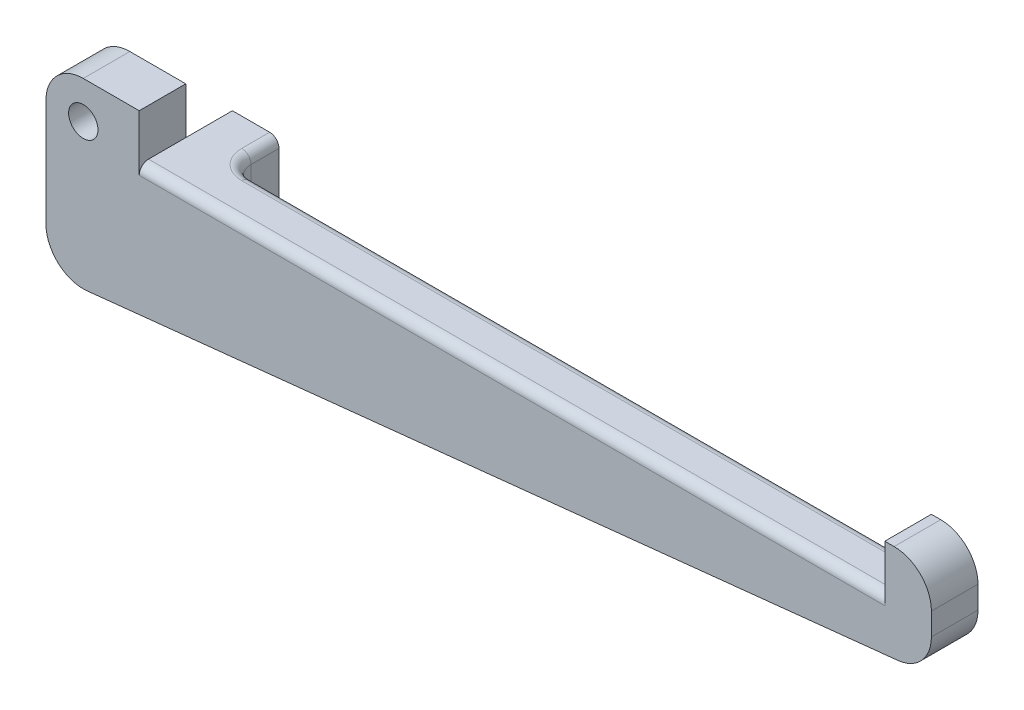
ISO-10303-21;
HEADER;
FILE_DESCRIPTION(('STEP AP214'),'2;1');
FILE_NAME('part.step','',(''),(''),'','','');
FILE_SCHEMA(('AUTOMOTIVE_DESIGN { 1 0 10303 214 1 1 1 1 }'));
ENDSEC;
DATA;
#1=APPLICATION_CONTEXT('core data for automotive mechanical design processes');
#2=APPLICATION_PROTOCOL_DEFINITION('international standard','automotive_design',2000,#1);
#3=PRODUCT_CONTEXT('',#1,'mechanical');
#4=PRODUCT('Part','Part','',(#3));
#5=PRODUCT_RELATED_PRODUCT_CATEGORY('part','',(#4));
#6=PRODUCT_DEFINITION_FORMATION('','',#4);
#7=PRODUCT_DEFINITION_CONTEXT('part definition',#1,'design');
#8=PRODUCT_DEFINITION('design','',#6,#7);
#9=PRODUCT_DEFINITION_SHAPE('','',#8);
#10=(LENGTH_UNIT() NAMED_UNIT(*) SI_UNIT(.MILLI.,.METRE.));
#11=(NAMED_UNIT(*) PLANE_ANGLE_UNIT() SI_UNIT($,.RADIAN.));
#12=(NAMED_UNIT(*) SI_UNIT($,.STERADIAN.) SOLID_ANGLE_UNIT());
#13=UNCERTAINTY_MEASURE_WITH_UNIT(LENGTH_MEASURE(1.E-05),#10,'distance_accuracy_value','');
#14=(GEOMETRIC_REPRESENTATION_CONTEXT(3) GLOBAL_UNCERTAINTY_ASSIGNED_CONTEXT((#13)) GLOBAL_UNIT_ASSIGNED_CONTEXT((#10,
#11,#12)) REPRESENTATION_CONTEXT('',''));
#15=CARTESIAN_POINT('',(0.,0.,0.));
#16=DIRECTION('',(0.,0.,1.));
#17=DIRECTION('',(1.,0.,0.));
#18=AXIS2_PLACEMENT_3D('',#15,#16,#17);
#19=CARTESIAN_POINT('',(5.08,-7.05719664596435,6.35));
#20=DIRECTION('',(0.,0.,-1.));
#21=DIRECTION('',(-1.,0.,0.));
#22=AXIS2_PLACEMENT_3D('',#19,#20,#21);
#23=CYLINDRICAL_SURFACE('',#22,5.08);
#24=CARTESIAN_POINT('',(5.08,-7.05719664596435,0.));
#25=DIRECTION('',(0.,0.,1.));
#26=DIRECTION('',(-1.,0.,0.));
#27=AXIS2_PLACEMENT_3D('',#24,#25,#26);
#28=CIRCLE('',#27,5.08);
#29=CARTESIAN_POINT('',(0.,-7.0571966459643,0.));
#30=VERTEX_POINT('',#29);
#31=CARTESIAN_POINT('',(5.6117987053517,-12.1092843468051,0.));
#32=VERTEX_POINT('',#31);
#33=EDGE_CURVE('E196',#30,#32,#28,.T.);
#34=ORIENTED_EDGE('',*,*,#33,.T.);
#35=DIRECTION('',(0.,0.,-1.));
#36=VECTOR('',#35,1.);
#37=CARTESIAN_POINT('',(5.6117987053517,-12.1092843468051,6.35));
#38=LINE('',#37,#36);
#39=CARTESIAN_POINT('',(5.6117987053517,-12.1092843468051,6.35));
#40=VERTEX_POINT('',#39);
#41=EDGE_CURVE('E326',#40,#32,#38,.T.);
#42=ORIENTED_EDGE('',*,*,#41,.F.);
#43=CARTESIAN_POINT('',(5.08,-7.05719664596435,6.35));
#44=DIRECTION('',(0.,0.,1.));
#45=DIRECTION('',(-1.,0.,0.));
#46=AXIS2_PLACEMENT_3D('',#43,#44,#45);
#47=CIRCLE('',#46,5.08);
#48=CARTESIAN_POINT('',(0.,-7.0571966459643,6.35));
#49=VERTEX_POINT('',#48);
#50=EDGE_CURVE('E228',#49,#40,#47,.T.);
#51=ORIENTED_EDGE('',*,*,#50,.F.);
#52=DIRECTION('',(0.,0.,-1.));
#53=VECTOR('',#52,1.);
#54=CARTESIAN_POINT('',(0.,-7.0571966459643,6.35));
#55=LINE('',#54,#53);
#56=EDGE_CURVE('E330',#49,#30,#55,.T.);
#57=ORIENTED_EDGE('',*,*,#56,.T.);
#58=EDGE_LOOP('',(#34,#42,#51,#57));
#59=FACE_BOUND('',#58,.T.);
#60=ADVANCED_FACE('F36',(#59),#23,.T.);
#61=CARTESIAN_POINT('',(116.101798705352,-0.478758031015618,6.35));
#62=DIRECTION('',(-0.104684784518043,0.994505452921406,0.));
#63=DIRECTION('',(-0.994505452921406,-0.104684784518043,0.));
#64=AXIS2_PLACEMENT_3D('',#61,#62,#63);
#65=PLANE('',#64);
#66=DIRECTION('',(0.994505452921406,0.104684784518043,0.));
#67=VECTOR('',#66,1.);
#68=CARTESIAN_POINT('',(116.101798705352,-0.478758031015618,0.));
#69=LINE('',#68,#67);
#70=CARTESIAN_POINT('',(116.101798705352,-0.478758031015619,0.));
#71=VERTEX_POINT('',#70);
#72=EDGE_CURVE('E261',#32,#71,#69,.T.);
#73=ORIENTED_EDGE('',*,*,#72,.T.);
#74=DIRECTION('',(0.,0.,-1.));
#75=VECTOR('',#74,1.);
#76=CARTESIAN_POINT('',(116.101798705352,-0.478758031015619,6.35));
#77=LINE('',#76,#75);
#78=CARTESIAN_POINT('',(116.101798705352,-0.478758031015619,6.35));
#79=VERTEX_POINT('',#78);
#80=EDGE_CURVE('E322',#79,#71,#77,.T.);
#81=ORIENTED_EDGE('',*,*,#80,.F.);
#82=DIRECTION('',(0.994505452921406,0.104684784518043,0.));
#83=VECTOR('',#82,1.);
#84=CARTESIAN_POINT('',(116.101798705352,-0.478758031015618,6.35));
#85=LINE('',#84,#83);
#86=EDGE_CURVE('E232',#40,#79,#85,.T.);
#87=ORIENTED_EDGE('',*,*,#86,.F.);
#88=ORIENTED_EDGE('',*,*,#41,.T.);
#89=EDGE_LOOP('',(#73,#81,#87,#88));
#90=FACE_BOUND('',#89,.T.);
#91=ADVANCED_FACE('F431',(#90),#65,.F.);
#92=CARTESIAN_POINT('',(115.57,4.57332966982513,6.35));
#93=DIRECTION('',(0.,0.,-1.));
#94=DIRECTION('',(-1.,0.,0.));
#95=AXIS2_PLACEMENT_3D('',#92,#93,#94);
#96=CYLINDRICAL_SURFACE('',#95,5.08);
#97=CARTESIAN_POINT('',(115.57,4.57332966982513,0.));
#98=DIRECTION('',(0.,0.,1.));
#99=DIRECTION('',(-1.,0.,0.));
#100=AXIS2_PLACEMENT_3D('',#97,#98,#99);
#101=CIRCLE('',#100,5.08);
#102=CARTESIAN_POINT('',(120.65,4.57332966982516,0.));
#103=VERTEX_POINT('',#102);
#104=EDGE_CURVE('E264',#71,#103,#101,.T.);
#105=ORIENTED_EDGE('',*,*,#104,.T.);
#106=DIRECTION('',(0.,0.,-1.));
#107=VECTOR('',#106,1.);
#108=CARTESIAN_POINT('',(120.65,4.57332966982516,6.35));
#109=LINE('',#108,#107);
#110=CARTESIAN_POINT('',(120.65,4.57332966982516,6.35));
#111=VERTEX_POINT('',#110);
#112=EDGE_CURVE('E318',#111,#103,#109,.T.);
#113=ORIENTED_EDGE('',*,*,#112,.F.);
#114=CARTESIAN_POINT('',(115.57,4.57332966982513,6.35));
#115=DIRECTION('',(0.,0.,1.));
#116=DIRECTION('',(-1.,0.,0.));
#117=AXIS2_PLACEMENT_3D('',#114,#115,#116);
#118=CIRCLE('',#117,5.08);
#119=EDGE_CURVE('E235',#79,#111,#118,.T.);
#120=ORIENTED_EDGE('',*,*,#119,.F.);
#121=ORIENTED_EDGE('',*,*,#80,.T.);
#122=EDGE_LOOP('',(#105,#113,#120,#121));
#123=FACE_BOUND('',#122,.T.);
#124=ADVANCED_FACE('F437',(#123),#96,.T.);
#125=CARTESIAN_POINT('',(120.65,7.61999999999996,6.35));
#126=DIRECTION('',(-1.,0.,0.));
#127=DIRECTION('',(0.,0.,1.));
#128=AXIS2_PLACEMENT_3D('',#125,#126,#127);
#129=PLANE('',#128);
#130=DIRECTION('',(0.,1.,0.));
#131=VECTOR('',#130,1.);
#132=CARTESIAN_POINT('',(120.65,7.61999999999996,0.));
#133=LINE('',#132,#131);
#134=CARTESIAN_POINT('',(120.65,7.61999999999996,0.));
#135=VERTEX_POINT('',#134);
#136=EDGE_CURVE('E267',#103,#135,#133,.T.);
#137=ORIENTED_EDGE('',*,*,#136,.T.);
#138=DIRECTION('',(0.,0.,-1.));
#139=VECTOR('',#138,1.);
#140=CARTESIAN_POINT('',(120.65,7.61999999999996,6.35));
#141=LINE('',#140,#139);
#142=CARTESIAN_POINT('',(120.65,7.61999999999996,6.35));
#143=VERTEX_POINT('',#142);
#144=EDGE_CURVE('E314',#143,#135,#141,.T.);
#145=ORIENTED_EDGE('',*,*,#144,.F.);
#146=DIRECTION('',(0.,1.,0.));
#147=VECTOR('',#146,1.);
#148=CARTESIAN_POINT('',(120.65,7.61999999999996,6.35));
#149=LINE('',#148,#147);
#150=EDGE_CURVE('E238',#111,#143,#149,.T.);
#151=ORIENTED_EDGE('',*,*,#150,.F.);
#152=ORIENTED_EDGE('',*,*,#112,.T.);
#153=EDGE_LOOP('',(#137,#145,#151,#152));
#154=FACE_BOUND('',#153,.T.);
#155=ADVANCED_FACE('F491',(#154),#129,.F.);
#156=CARTESIAN_POINT('',(115.57,7.62,6.35));
#157=DIRECTION('',(0.,0.,-1.));
#158=DIRECTION('',(-1.,0.,0.));
#159=AXIS2_PLACEMENT_3D('',#156,#157,#158);
#160=CYLINDRICAL_SURFACE('',#159,5.08);
#161=CARTESIAN_POINT('',(115.57,7.62,0.));
#162=DIRECTION('',(0.,0.,1.));
#163=DIRECTION('',(-1.,0.,0.));
#164=AXIS2_PLACEMENT_3D('',#161,#162,#163);
#165=CIRCLE('',#164,5.08);
#166=CARTESIAN_POINT('',(115.57,12.7,0.));
#167=VERTEX_POINT('',#166);
#168=EDGE_CURVE('E270',#135,#167,#165,.T.);
#169=ORIENTED_EDGE('',*,*,#168,.T.);
#170=DIRECTION('',(0.,0.,-1.));
#171=VECTOR('',#170,1.);
#172=CARTESIAN_POINT('',(115.57,12.7,6.35));
#173=LINE('',#172,#171);
#174=CARTESIAN_POINT('',(115.57,12.7,6.35));
#175=VERTEX_POINT('',#174);
#176=EDGE_CURVE('E310',#175,#167,#173,.T.);
#177=ORIENTED_EDGE('',*,*,#176,.F.);
#178=CARTESIAN_POINT('',(115.57,7.62,6.35));
#179=DIRECTION('',(0.,0.,1.));
#180=DIRECTION('',(-1.,0.,0.));
#181=AXIS2_PLACEMENT_3D('',#178,#179,#180);
#182=CIRCLE('',#181,5.08);
#183=EDGE_CURVE('E241',#143,#175,#182,.T.);
#184=ORIENTED_EDGE('',*,*,#183,.F.);
#185=ORIENTED_EDGE('',*,*,#144,.T.);
#186=EDGE_LOOP('',(#169,#177,#184,#185));
#187=FACE_BOUND('',#186,.T.);
#188=ADVANCED_FACE('F487',(#187),#160,.T.);
#189=CARTESIAN_POINT('',(114.3,12.7,6.35));
#190=DIRECTION('',(0.,-1.,0.));
#191=DIRECTION('',(0.,0.,-1.));
#192=AXIS2_PLACEMENT_3D('',#189,#190,#191);
#193=PLANE('',#192);
#194=DIRECTION('',(-1.,0.,0.));
#195=VECTOR('',#194,1.);
#196=CARTESIAN_POINT('',(114.3,12.7,0.));
#197=LINE('',#196,#195);
#198=CARTESIAN_POINT('',(114.3,12.7,0.));
#199=VERTEX_POINT('',#198);
#200=EDGE_CURVE('E273',#167,#199,#197,.T.);
#201=ORIENTED_EDGE('',*,*,#200,.T.);
#202=DIRECTION('',(0.,0.,-1.));
#203=VECTOR('',#202,1.);
#204=CARTESIAN_POINT('',(114.3,12.7,6.35));
#205=LINE('',#204,#203);
#206=CARTESIAN_POINT('',(114.3,12.7,6.35));
#207=VERTEX_POINT('',#206);
#208=EDGE_CURVE('E307',#207,#199,#205,.T.);
#209=ORIENTED_EDGE('',*,*,#208,.F.);
#210=DIRECTION('',(-1.,0.,0.));
#211=VECTOR('',#210,1.);
#212=CARTESIAN_POINT('',(114.3,12.7,6.35));
#213=LINE('',#212,#211);
#214=EDGE_CURVE('E244',#175,#207,#213,.T.);
#215=ORIENTED_EDGE('',*,*,#214,.F.);
#216=ORIENTED_EDGE('',*,*,#176,.T.);
#217=EDGE_LOOP('',(#201,#209,#215,#216));
#218=FACE_BOUND('',#217,.T.);
#219=ADVANCED_FACE('F484',(#218),#193,.F.);
#220=CARTESIAN_POINT('',(114.3,6.35,6.35));
#221=DIRECTION('',(1.,0.,0.));
#222=DIRECTION('',(0.,0.,-1.));
#223=AXIS2_PLACEMENT_3D('',#220,#221,#222);
#224=PLANE('',#223);
#225=DIRECTION('',(0.,-1.,0.));
#226=VECTOR('',#225,1.);
#227=CARTESIAN_POINT('',(114.3,6.35,0.));
#228=LINE('',#227,#226);
#229=CARTESIAN_POINT('',(114.3,5.08,0.));
#230=VERTEX_POINT('',#229);
#231=EDGE_CURVE('E53',#199,#230,#228,.T.);
#232=ORIENTED_EDGE('',*,*,#231,.T.);
#233=CARTESIAN_POINT('',(114.3,5.08,1.27));
#234=DIRECTION('',(1.,0.,0.));
#235=DIRECTION('',(0.,0.,-1.));
#236=AXIS2_PLACEMENT_3D('',#233,#234,#235);
#237=CIRCLE('',#236,1.27);
#238=CARTESIAN_POINT('',(114.3,6.35,1.27));
#239=VERTEX_POINT('',#238);
#240=EDGE_CURVE('E11',#230,#239,#237,.T.);
#241=ORIENTED_EDGE('',*,*,#240,.T.);
#242=DIRECTION('',(0.,0.,-1.));
#243=VECTOR('',#242,1.);
#244=CARTESIAN_POINT('',(114.3,6.35,6.35));
#245=LINE('',#244,#243);
#246=CARTESIAN_POINT('',(114.3,6.35,5.08));
#247=VERTEX_POINT('',#246);
#248=EDGE_CURVE('E303',#247,#239,#245,.T.);
#249=ORIENTED_EDGE('',*,*,#248,.F.);
#250=CARTESIAN_POINT('',(114.3,5.08,5.08));
#251=DIRECTION('',(1.,0.,0.));
#252=DIRECTION('',(0.,0.,-1.));
#253=AXIS2_PLACEMENT_3D('',#250,#251,#252);
#254=CIRCLE('',#253,1.27);
#255=CARTESIAN_POINT('',(114.3,5.08,6.35));
#256=VERTEX_POINT('',#255);
#257=EDGE_CURVE('E46',#247,#256,#254,.T.);
#258=ORIENTED_EDGE('',*,*,#257,.T.);
#259=DIRECTION('',(0.,-1.,0.));
#260=VECTOR('',#259,1.);
#261=CARTESIAN_POINT('',(114.3,6.35,6.35));
#262=LINE('',#261,#260);
#263=EDGE_CURVE('E247',#207,#256,#262,.T.);
#264=ORIENTED_EDGE('',*,*,#263,.F.);
#265=ORIENTED_EDGE('',*,*,#208,.T.);
#266=EDGE_LOOP('',(#232,#241,#249,#258,#264,#265));
#267=FACE_BOUND('',#266,.T.);
#268=ADVANCED_FACE('F413',(#267),#224,.F.);
#269=CARTESIAN_POINT('',(12.7,6.35,6.35));
#270=DIRECTION('',(0.,-1.,0.));
#271=DIRECTION('',(0.,0.,-1.));
#272=AXIS2_PLACEMENT_3D('',#269,#270,#271);
#273=PLANE('',#272);
#274=DIRECTION('',(0.,0.,-1.));
#275=VECTOR('',#274,1.);
#276=CARTESIAN_POINT('',(12.7,6.35,6.35));
#277=LINE('',#276,#275);
#278=CARTESIAN_POINT('',(12.7,6.35,5.08));
#279=VERTEX_POINT('',#278);
#280=CARTESIAN_POINT('',(12.7,6.35,0.));
#281=VERTEX_POINT('',#280);
#282=EDGE_CURVE('E300',#279,#281,#277,.T.);
#283=ORIENTED_EDGE('',*,*,#282,.F.);
#284=DIRECTION('',(-1.,0.,0.));
#285=VECTOR('',#284,1.);
#286=CARTESIAN_POINT('',(12.7,6.35,5.08));
#287=LINE('',#286,#285);
#288=EDGE_CURVE('E355',#279,#247,#287,.F.);
#289=ORIENTED_EDGE('',*,*,#288,.T.);
#290=ORIENTED_EDGE('',*,*,#248,.T.);
#291=DIRECTION('',(-1.,0.,0.));
#292=VECTOR('',#291,1.);
#293=CARTESIAN_POINT('',(21.59,6.35,1.27));
#294=LINE('',#293,#292);
#295=CARTESIAN_POINT('',(21.59,6.35,1.27));
#296=VERTEX_POINT('',#295);
#297=EDGE_CURVE('E346',#239,#296,#294,.T.);
#298=ORIENTED_EDGE('',*,*,#297,.T.);
#299=CARTESIAN_POINT('',(21.59,6.35,-2.54));
#300=DIRECTION('',(0.,-1.,0.));
#301=DIRECTION('',(0.,0.,-1.));
#302=AXIS2_PLACEMENT_3D('',#299,#300,#301);
#303=CIRCLE('',#302,3.81);
#304=CARTESIAN_POINT('',(17.78,6.35,-2.54));
#305=VERTEX_POINT('',#304);
#306=EDGE_CURVE('E349',#296,#305,#303,.T.);
#307=ORIENTED_EDGE('',*,*,#306,.T.);
#308=DIRECTION('',(0.,0.,1.));
#309=VECTOR('',#308,1.);
#310=CARTESIAN_POINT('',(17.78,6.35,6.35));
#311=LINE('',#310,#309);
#312=CARTESIAN_POINT('',(17.78,6.35,-6.35));
#313=VERTEX_POINT('',#312);
#314=EDGE_CURVE('E352',#305,#313,#311,.F.);
#315=ORIENTED_EDGE('',*,*,#314,.T.);
#316=DIRECTION('',(1.,0.,0.));
#317=VECTOR('',#316,1.);
#318=CARTESIAN_POINT('',(12.7,6.35,-6.35));
#319=LINE('',#318,#317);
#320=CARTESIAN_POINT('',(12.7,6.35,-6.35));
#321=VERTEX_POINT('',#320);
#322=EDGE_CURVE('E185',#321,#313,#319,.T.);
#323=ORIENTED_EDGE('',*,*,#322,.F.);
#324=DIRECTION('',(0.,0.,1.));
#325=VECTOR('',#324,1.);
#326=CARTESIAN_POINT('',(12.7,6.35,-6.35));
#327=LINE('',#326,#325);
#328=EDGE_CURVE('E208',#321,#281,#327,.T.);
#329=ORIENTED_EDGE('',*,*,#328,.T.);
#330=EDGE_LOOP('',(#283,#289,#290,#298,#307,#315,#323,#329));
#331=FACE_BOUND('',#330,.T.);
#332=ADVANCED_FACE('F405',(#331),#273,.F.);
#333=CARTESIAN_POINT('',(12.7,12.7,6.35));
#334=DIRECTION('',(-1.,0.,0.));
#335=DIRECTION('',(0.,-1.,0.));
#336=AXIS2_PLACEMENT_3D('',#333,#334,#335);
#337=PLANE('',#336);
#338=DIRECTION('',(0.,1.,0.));
#339=VECTOR('',#338,1.);
#340=CARTESIAN_POINT('',(12.7,12.7,0.));
#341=LINE('',#340,#339);
#342=CARTESIAN_POINT('',(12.7,12.7,0.));
#343=VERTEX_POINT('',#342);
#344=EDGE_CURVE('E278',#281,#343,#341,.T.);
#345=ORIENTED_EDGE('',*,*,#344,.T.);
#346=DIRECTION('',(0.,0.,-1.));
#347=VECTOR('',#346,1.);
#348=CARTESIAN_POINT('',(12.7,12.7,6.35));
#349=LINE('',#348,#347);
#350=CARTESIAN_POINT('',(12.7,12.7,6.35));
#351=VERTEX_POINT('',#350);
#352=EDGE_CURVE('E296',#351,#343,#349,.T.);
#353=ORIENTED_EDGE('',*,*,#352,.F.);
#354=DIRECTION('',(0.,1.,0.));
#355=VECTOR('',#354,1.);
#356=CARTESIAN_POINT('',(12.7,12.7,6.35));
#357=LINE('',#356,#355);
#358=CARTESIAN_POINT('',(12.7,5.08,6.35));
#359=VERTEX_POINT('',#358);
#360=EDGE_CURVE('E61',#359,#351,#357,.T.);
#361=ORIENTED_EDGE('',*,*,#360,.F.);
#362=CARTESIAN_POINT('',(12.7,5.08,5.08));
#363=DIRECTION('',(-1.,0.,0.));
#364=DIRECTION('',(0.,-1.,0.));
#365=AXIS2_PLACEMENT_3D('',#362,#363,#364);
#366=CIRCLE('',#365,1.27);
#367=EDGE_CURVE('E370',#359,#279,#366,.T.);
#368=ORIENTED_EDGE('',*,*,#367,.T.);
#369=ORIENTED_EDGE('',*,*,#282,.T.);
#370=EDGE_LOOP('',(#345,#353,#361,#368,#369));
#371=FACE_BOUND('',#370,.T.);
#372=ADVANCED_FACE('F476',(#371),#337,.F.);
#373=CARTESIAN_POINT('',(5.08000000000004,12.7,6.35));
#374=DIRECTION('',(0.,-1.,0.));
#375=DIRECTION('',(0.,0.,-1.));
#376=AXIS2_PLACEMENT_3D('',#373,#374,#375);
#377=PLANE('',#376);
#378=DIRECTION('',(-1.,0.,0.));
#379=VECTOR('',#378,1.);
#380=CARTESIAN_POINT('',(5.08000000000004,12.7,0.));
#381=LINE('',#380,#379);
#382=CARTESIAN_POINT('',(5.08000000000004,12.7,0.));
#383=VERTEX_POINT('',#382);
#384=EDGE_CURVE('E281',#343,#383,#381,.T.);
#385=ORIENTED_EDGE('',*,*,#384,.T.);
#386=DIRECTION('',(0.,0.,-1.));
#387=VECTOR('',#386,1.);
#388=CARTESIAN_POINT('',(5.08000000000004,12.7,6.35));
#389=LINE('',#388,#387);
#390=CARTESIAN_POINT('',(5.08000000000004,12.7,6.35));
#391=VERTEX_POINT('',#390);
#392=EDGE_CURVE('E292',#391,#383,#389,.T.);
#393=ORIENTED_EDGE('',*,*,#392,.F.);
#394=DIRECTION('',(-1.,0.,0.));
#395=VECTOR('',#394,1.);
#396=CARTESIAN_POINT('',(5.08000000000004,12.7,6.35));
#397=LINE('',#396,#395);
#398=EDGE_CURVE('E251',#351,#391,#397,.T.);
#399=ORIENTED_EDGE('',*,*,#398,.F.);
#400=ORIENTED_EDGE('',*,*,#352,.T.);
#401=EDGE_LOOP('',(#385,#393,#399,#400));
#402=FACE_BOUND('',#401,.T.);
#403=ADVANCED_FACE('F472',(#402),#377,.F.);
#404=CARTESIAN_POINT('',(5.08,7.62,6.35));
#405=DIRECTION('',(0.,0.,-1.));
#406=DIRECTION('',(-1.,0.,0.));
#407=AXIS2_PLACEMENT_3D('',#404,#405,#406);
#408=CYLINDRICAL_SURFACE('',#407,5.08);
#409=CARTESIAN_POINT('',(5.08,7.62,0.));
#410=DIRECTION('',(0.,0.,1.));
#411=DIRECTION('',(-1.,0.,0.));
#412=AXIS2_PLACEMENT_3D('',#409,#410,#411);
#413=CIRCLE('',#412,5.08);
#414=CARTESIAN_POINT('',(0.,7.61999999999996,0.));
#415=VERTEX_POINT('',#414);
#416=EDGE_CURVE('E284',#383,#415,#413,.T.);
#417=ORIENTED_EDGE('',*,*,#416,.T.);
#418=DIRECTION('',(0.,0.,-1.));
#419=VECTOR('',#418,1.);
#420=CARTESIAN_POINT('',(0.,7.61999999999996,6.35));
#421=LINE('',#420,#419);
#422=CARTESIAN_POINT('',(0.,7.61999999999996,6.35));
#423=VERTEX_POINT('',#422);
#424=EDGE_CURVE('E258',#423,#415,#421,.T.);
#425=ORIENTED_EDGE('',*,*,#424,.F.);
#426=CARTESIAN_POINT('',(5.08,7.62,6.35));
#427=DIRECTION('',(0.,0.,1.));
#428=DIRECTION('',(-1.,0.,0.));
#429=AXIS2_PLACEMENT_3D('',#426,#427,#428);
#430=CIRCLE('',#429,5.08);
#431=EDGE_CURVE('E254',#391,#423,#430,.T.);
#432=ORIENTED_EDGE('',*,*,#431,.F.);
#433=ORIENTED_EDGE('',*,*,#392,.T.);
#434=EDGE_LOOP('',(#417,#425,#432,#433));
#435=FACE_BOUND('',#434,.T.);
#436=ADVANCED_FACE('F468',(#435),#408,.T.);
#437=CARTESIAN_POINT('',(0.,0.,6.35));
#438=DIRECTION('',(1.,0.,0.));
#439=DIRECTION('',(0.,0.,-1.));
#440=AXIS2_PLACEMENT_3D('',#437,#438,#439);
#441=PLANE('',#440);
#442=DIRECTION('',(0.,-1.,0.));
#443=VECTOR('',#442,1.);
#444=CARTESIAN_POINT('',(0.,0.,0.));
#445=LINE('',#444,#443);
#446=EDGE_CURVE('E229',#415,#30,#445,.T.);
#447=ORIENTED_EDGE('',*,*,#446,.T.);
#448=ORIENTED_EDGE('',*,*,#56,.F.);
#449=DIRECTION('',(0.,-1.,0.));
#450=VECTOR('',#449,1.);
#451=CARTESIAN_POINT('',(0.,-7.05719664596431,6.35));
#452=LINE('',#451,#450);
#453=EDGE_CURVE('E224',#423,#49,#452,.T.);
#454=ORIENTED_EDGE('',*,*,#453,.F.);
#455=ORIENTED_EDGE('',*,*,#424,.T.);
#456=EDGE_LOOP('',(#447,#448,#454,#455));
#457=FACE_BOUND('',#456,.T.);
#458=ADVANCED_FACE('F462',(#457),#441,.F.);
#459=CARTESIAN_POINT('',(5.08,7.62,6.35));
#460=DIRECTION('',(0.,0.,-1.));
#461=DIRECTION('',(-1.,0.,0.));
#462=AXIS2_PLACEMENT_3D('',#459,#460,#461);
#463=PLANE('',#462);
#464=CARTESIAN_POINT('',(5.08,7.62,6.35));
#465=DIRECTION('',(0.,0.,-1.));
#466=DIRECTION('',(-1.,0.,0.));
#467=AXIS2_PLACEMENT_3D('',#464,#465,#466);
#468=CIRCLE('',#467,2.);
#469=CARTESIAN_POINT('',(3.08,7.62,6.35));
#470=VERTEX_POINT('',#469);
#471=EDGE_CURVE('E377',#470,#470,#468,.T.);
#472=ORIENTED_EDGE('',*,*,#471,.T.);
#473=EDGE_LOOP('',(#472));
#474=FACE_BOUND('',#473,.T.);
#475=DIRECTION('',(-1.,0.,0.));
#476=VECTOR('',#475,1.);
#477=CARTESIAN_POINT('',(5.08,5.08,6.35));
#478=LINE('',#477,#476);
#479=EDGE_CURVE('E363',#256,#359,#478,.T.);
#480=ORIENTED_EDGE('',*,*,#479,.T.);
#481=ORIENTED_EDGE('',*,*,#360,.T.);
#482=ORIENTED_EDGE('',*,*,#398,.T.);
#483=ORIENTED_EDGE('',*,*,#431,.T.);
#484=ORIENTED_EDGE('',*,*,#453,.T.);
#485=ORIENTED_EDGE('',*,*,#50,.T.);
#486=ORIENTED_EDGE('',*,*,#86,.T.);
#487=ORIENTED_EDGE('',*,*,#119,.T.);
#488=ORIENTED_EDGE('',*,*,#150,.T.);
#489=ORIENTED_EDGE('',*,*,#183,.T.);
#490=ORIENTED_EDGE('',*,*,#214,.T.);
#491=ORIENTED_EDGE('',*,*,#263,.T.);
#492=EDGE_LOOP('',(#480,#481,#482,#483,#484,#485,#486,#487,#488,#489,#490,#491));
#493=FACE_BOUND('',#492,.T.);
#494=ADVANCED_FACE('F459',(#474,#493),#463,.F.);
#495=CARTESIAN_POINT('',(5.08,7.62,0.));
#496=DIRECTION('',(0.,0.,-1.));
#497=DIRECTION('',(-1.,0.,0.));
#498=AXIS2_PLACEMENT_3D('',#495,#496,#497);
#499=PLANE('',#498);
#500=CARTESIAN_POINT('',(5.08,7.62,0.));
#501=DIRECTION('',(0.,0.,-1.));
#502=DIRECTION('',(-1.,0.,0.));
#503=AXIS2_PLACEMENT_3D('',#500,#501,#502);
#504=CIRCLE('',#503,2.);
#505=CARTESIAN_POINT('',(3.08,7.62,0.));
#506=VERTEX_POINT('',#505);
#507=EDGE_CURVE('E386',#506,#506,#504,.T.);
#508=ORIENTED_EDGE('',*,*,#507,.F.);
#509=EDGE_LOOP('',(#508));
#510=FACE_BOUND('',#509,.T.);
#511=DIRECTION('',(0.,-1.,0.));
#512=VECTOR('',#511,1.);
#513=CARTESIAN_POINT('',(21.59,7.62,0.));
#514=LINE('',#513,#512);
#515=CARTESIAN_POINT('',(21.59,-6.35,0.));
#516=VERTEX_POINT('',#515);
#517=CARTESIAN_POINT('',(21.59,5.08,0.));
#518=VERTEX_POINT('',#517);
#519=EDGE_CURVE('E336',#516,#518,#514,.F.);
#520=ORIENTED_EDGE('',*,*,#519,.T.);
#521=DIRECTION('',(-1.,0.,0.));
#522=VECTOR('',#521,1.);
#523=CARTESIAN_POINT('',(114.3,5.08,0.));
#524=LINE('',#523,#522);
#525=EDGE_CURVE('E367',#518,#230,#524,.F.);
#526=ORIENTED_EDGE('',*,*,#525,.T.);
#527=ORIENTED_EDGE('',*,*,#231,.F.);
#528=ORIENTED_EDGE('',*,*,#200,.F.);
#529=ORIENTED_EDGE('',*,*,#168,.F.);
#530=ORIENTED_EDGE('',*,*,#136,.F.);
#531=ORIENTED_EDGE('',*,*,#104,.F.);
#532=ORIENTED_EDGE('',*,*,#72,.F.);
#533=ORIENTED_EDGE('',*,*,#33,.F.);
#534=ORIENTED_EDGE('',*,*,#446,.F.);
#535=ORIENTED_EDGE('',*,*,#416,.F.);
#536=ORIENTED_EDGE('',*,*,#384,.F.);
#537=ORIENTED_EDGE('',*,*,#344,.F.);
#538=DIRECTION('',(0.,1.,0.));
#539=VECTOR('',#538,1.);
#540=CARTESIAN_POINT('',(12.7,6.35,0.));
#541=LINE('',#540,#539);
#542=CARTESIAN_POINT('',(12.7,-6.35,0.));
#543=VERTEX_POINT('',#542);
#544=EDGE_CURVE('E215',#543,#281,#541,.T.);
#545=ORIENTED_EDGE('',*,*,#544,.F.);
#546=DIRECTION('',(-1.,0.,0.));
#547=VECTOR('',#546,1.);
#548=CARTESIAN_POINT('',(12.7,-6.35,0.));
#549=LINE('',#548,#547);
#550=EDGE_CURVE('E212',#516,#543,#549,.T.);
#551=ORIENTED_EDGE('',*,*,#550,.F.);
#552=EDGE_LOOP('',(#520,#526,#527,#528,#529,#530,#531,#532,#533,#534,#535,#536,#537,#545,#551));
#553=FACE_BOUND('',#552,.T.);
#554=ADVANCED_FACE('F458',(#510,#553),#499,.T.);
#555=CARTESIAN_POINT('',(19.05,6.35,-6.35));
#556=DIRECTION('',(-1.,0.,0.));
#557=DIRECTION('',(0.,0.,1.));
#558=AXIS2_PLACEMENT_3D('',#555,#556,#557);
#559=PLANE('',#558);
#560=DIRECTION('',(0.,-1.,0.));
#561=VECTOR('',#560,1.);
#562=CARTESIAN_POINT('',(19.05,6.35,-6.35));
#563=LINE('',#562,#561);
#564=CARTESIAN_POINT('',(19.05,5.08,-6.35));
#565=VERTEX_POINT('',#564);
#566=CARTESIAN_POINT('',(19.05,-6.35,-6.35));
#567=VERTEX_POINT('',#566);
#568=EDGE_CURVE('E172',#565,#567,#563,.T.);
#569=ORIENTED_EDGE('',*,*,#568,.F.);
#570=DIRECTION('',(0.,0.,1.));
#571=VECTOR('',#570,1.);
#572=CARTESIAN_POINT('',(19.05,5.08,-6.35));
#573=LINE('',#572,#571);
#574=CARTESIAN_POINT('',(19.05,5.08,-2.54));
#575=VERTEX_POINT('',#574);
#576=EDGE_CURVE('E343',#565,#575,#573,.T.);
#577=ORIENTED_EDGE('',*,*,#576,.T.);
#578=DIRECTION('',(0.,-1.,0.));
#579=VECTOR('',#578,1.);
#580=CARTESIAN_POINT('',(19.05,6.35,-2.54));
#581=LINE('',#580,#579);
#582=CARTESIAN_POINT('',(19.05,-6.35,-2.54));
#583=VERTEX_POINT('',#582);
#584=EDGE_CURVE('E191',#575,#583,#581,.T.);
#585=ORIENTED_EDGE('',*,*,#584,.T.);
#586=DIRECTION('',(0.,0.,1.));
#587=VECTOR('',#586,1.);
#588=CARTESIAN_POINT('',(19.05,-6.35,-6.35));
#589=LINE('',#588,#587);
#590=EDGE_CURVE('E188',#567,#583,#589,.T.);
#591=ORIENTED_EDGE('',*,*,#590,.F.);
#592=EDGE_LOOP('',(#569,#577,#585,#591));
#593=FACE_BOUND('',#592,.T.);
#594=ADVANCED_FACE('F189',(#593),#559,.F.);
#595=CARTESIAN_POINT('',(12.7,-6.35,-6.35));
#596=DIRECTION('',(0.,1.,0.));
#597=DIRECTION('',(0.,0.,1.));
#598=AXIS2_PLACEMENT_3D('',#595,#596,#597);
#599=PLANE('',#598);
#600=ORIENTED_EDGE('',*,*,#550,.T.);
#601=DIRECTION('',(0.,0.,1.));
#602=VECTOR('',#601,1.);
#603=CARTESIAN_POINT('',(12.7,-6.35,-6.35));
#604=LINE('',#603,#602);
#605=CARTESIAN_POINT('',(12.7,-6.35,-6.35));
#606=VERTEX_POINT('',#605);
#607=EDGE_CURVE('E197',#606,#543,#604,.T.);
#608=ORIENTED_EDGE('',*,*,#607,.F.);
#609=DIRECTION('',(-1.,0.,0.));
#610=VECTOR('',#609,1.);
#611=CARTESIAN_POINT('',(12.7,-6.35,-6.35));
#612=LINE('',#611,#610);
#613=EDGE_CURVE('E177',#567,#606,#612,.T.);
#614=ORIENTED_EDGE('',*,*,#613,.F.);
#615=ORIENTED_EDGE('',*,*,#590,.T.);
#616=CARTESIAN_POINT('',(21.59,-6.35,-2.54));
#617=DIRECTION('',(0.,1.,0.));
#618=DIRECTION('',(0.,0.,1.));
#619=AXIS2_PLACEMENT_3D('',#616,#617,#618);
#620=CIRCLE('',#619,2.54);
#621=EDGE_CURVE('E340',#583,#516,#620,.T.);
#622=ORIENTED_EDGE('',*,*,#621,.T.);
#623=EDGE_LOOP('',(#600,#608,#614,#615,#622));
#624=FACE_BOUND('',#623,.T.);
#625=ADVANCED_FACE('F200',(#624),#599,.F.);
#626=CARTESIAN_POINT('',(12.7,6.35,-6.35));
#627=DIRECTION('',(1.,0.,0.));
#628=DIRECTION('',(0.,0.,-1.));
#629=AXIS2_PLACEMENT_3D('',#626,#627,#628);
#630=PLANE('',#629);
#631=ORIENTED_EDGE('',*,*,#544,.T.);
#632=ORIENTED_EDGE('',*,*,#328,.F.);
#633=DIRECTION('',(0.,1.,0.));
#634=VECTOR('',#633,1.);
#635=CARTESIAN_POINT('',(12.7,6.35,-6.35));
#636=LINE('',#635,#634);
#637=EDGE_CURVE('E204',#606,#321,#636,.T.);
#638=ORIENTED_EDGE('',*,*,#637,.F.);
#639=ORIENTED_EDGE('',*,*,#607,.T.);
#640=EDGE_LOOP('',(#631,#632,#638,#639));
#641=FACE_BOUND('',#640,.T.);
#642=ADVANCED_FACE('F403',(#641),#630,.F.);
#643=CARTESIAN_POINT('',(0.,0.,-6.35));
#644=DIRECTION('',(0.,0.,-1.));
#645=DIRECTION('',(-1.,0.,0.));
#646=AXIS2_PLACEMENT_3D('',#643,#644,#645);
#647=PLANE('',#646);
#648=ORIENTED_EDGE('',*,*,#322,.T.);
#649=CARTESIAN_POINT('',(17.78,5.08,-6.35));
#650=DIRECTION('',(0.,0.,-1.));
#651=DIRECTION('',(-1.,0.,0.));
#652=AXIS2_PLACEMENT_3D('',#649,#650,#651);
#653=CIRCLE('',#652,1.27);
#654=EDGE_CURVE('E180',#313,#565,#653,.T.);
#655=ORIENTED_EDGE('',*,*,#654,.T.);
#656=ORIENTED_EDGE('',*,*,#568,.T.);
#657=ORIENTED_EDGE('',*,*,#613,.T.);
#658=ORIENTED_EDGE('',*,*,#637,.T.);
#659=EDGE_LOOP('',(#648,#655,#656,#657,#658));
#660=FACE_BOUND('',#659,.T.);
#661=ADVANCED_FACE('F175',(#660),#647,.T.);
#662=CARTESIAN_POINT('',(21.59,6.35,-2.54));
#663=DIRECTION('',(0.,-1.,0.));
#664=DIRECTION('',(0.,0.,-1.));
#665=AXIS2_PLACEMENT_3D('',#662,#663,#664);
#666=CYLINDRICAL_SURFACE('',#665,2.54);
#667=ORIENTED_EDGE('',*,*,#584,.F.);
#668=CARTESIAN_POINT('',(21.59,5.08,-2.54));
#669=DIRECTION('',(0.,-1.,0.));
#670=DIRECTION('',(0.,0.,-1.));
#671=AXIS2_PLACEMENT_3D('',#668,#669,#670);
#672=CIRCLE('',#671,2.54);
#673=EDGE_CURVE('E360',#575,#518,#672,.F.);
#674=ORIENTED_EDGE('',*,*,#673,.T.);
#675=ORIENTED_EDGE('',*,*,#519,.F.);
#676=ORIENTED_EDGE('',*,*,#621,.F.);
#677=EDGE_LOOP('',(#667,#674,#675,#676));
#678=FACE_BOUND('',#677,.T.);
#679=ADVANCED_FACE('F399',(#678),#666,.F.);
#680=CARTESIAN_POINT('',(12.7,5.08,1.27));
#681=DIRECTION('',(1.,0.,0.));
#682=DIRECTION('',(0.,0.,-1.));
#683=AXIS2_PLACEMENT_3D('',#680,#681,#682);
#684=CYLINDRICAL_SURFACE('',#683,1.27);
#685=ORIENTED_EDGE('',*,*,#240,.F.);
#686=ORIENTED_EDGE('',*,*,#525,.F.);
#687=CARTESIAN_POINT('',(21.59,5.08,1.27));
#688=DIRECTION('',(-1.,0.,0.));
#689=DIRECTION('',(0.,0.,1.));
#690=AXIS2_PLACEMENT_3D('',#687,#688,#689);
#691=CIRCLE('',#690,1.27);
#692=EDGE_CURVE('E40',#296,#518,#691,.T.);
#693=ORIENTED_EDGE('',*,*,#692,.F.);
#694=ORIENTED_EDGE('',*,*,#297,.F.);
#695=EDGE_LOOP('',(#685,#686,#693,#694));
#696=FACE_BOUND('',#695,.T.);
#697=ADVANCED_FACE('F418',(#696),#684,.T.);
#698=CARTESIAN_POINT('',(21.59,5.08,-2.54));
#699=DIRECTION('',(0.,-1.,0.));
#700=DIRECTION('',(0.,0.,-1.));
#701=AXIS2_PLACEMENT_3D('',#698,#699,#700);
#702=TOROIDAL_SURFACE('',#701,3.81,1.27);
#703=ORIENTED_EDGE('',*,*,#692,.T.);
#704=ORIENTED_EDGE('',*,*,#673,.F.);
#705=CARTESIAN_POINT('',(17.78,5.08,-2.54));
#706=DIRECTION('',(0.,0.,-1.));
#707=DIRECTION('',(-1.,0.,0.));
#708=AXIS2_PLACEMENT_3D('',#705,#706,#707);
#709=CIRCLE('',#708,1.27);
#710=EDGE_CURVE('E375',#305,#575,#709,.T.);
#711=ORIENTED_EDGE('',*,*,#710,.F.);
#712=ORIENTED_EDGE('',*,*,#306,.F.);
#713=EDGE_LOOP('',(#703,#704,#711,#712));
#714=FACE_BOUND('',#713,.T.);
#715=ADVANCED_FACE('F422',(#714),#702,.T.);
#716=CARTESIAN_POINT('',(17.78,5.08,-6.35));
#717=DIRECTION('',(0.,0.,1.));
#718=DIRECTION('',(1.,0.,0.));
#719=AXIS2_PLACEMENT_3D('',#716,#717,#718);
#720=CYLINDRICAL_SURFACE('',#719,1.27);
#721=ORIENTED_EDGE('',*,*,#654,.F.);
#722=ORIENTED_EDGE('',*,*,#314,.F.);
#723=ORIENTED_EDGE('',*,*,#710,.T.);
#724=ORIENTED_EDGE('',*,*,#576,.F.);
#725=EDGE_LOOP('',(#721,#722,#723,#724));
#726=FACE_BOUND('',#725,.T.);
#727=ADVANCED_FACE('F397',(#726),#720,.T.);
#728=CARTESIAN_POINT('',(5.08,5.08,5.08));
#729=DIRECTION('',(-1.,0.,0.));
#730=DIRECTION('',(0.,0.,1.));
#731=AXIS2_PLACEMENT_3D('',#728,#729,#730);
#732=CYLINDRICAL_SURFACE('',#731,1.27);
#733=ORIENTED_EDGE('',*,*,#257,.F.);
#734=ORIENTED_EDGE('',*,*,#288,.F.);
#735=ORIENTED_EDGE('',*,*,#367,.F.);
#736=ORIENTED_EDGE('',*,*,#479,.F.);
#737=EDGE_LOOP('',(#733,#734,#735,#736));
#738=FACE_BOUND('',#737,.T.);
#739=ADVANCED_FACE('F38',(#738),#732,.T.);
#740=CARTESIAN_POINT('',(5.08,7.62,6.35));
#741=DIRECTION('',(0.,0.,-1.));
#742=DIRECTION('',(-1.,0.,0.));
#743=AXIS2_PLACEMENT_3D('',#740,#741,#742);
#744=CYLINDRICAL_SURFACE('',#743,2.);
#745=ORIENTED_EDGE('',*,*,#471,.F.);
#746=EDGE_LOOP('',(#745));
#747=FACE_BOUND('',#746,.T.);
#748=ORIENTED_EDGE('',*,*,#507,.T.);
#749=EDGE_LOOP('',(#748));
#750=FACE_BOUND('',#749,.T.);
#751=ADVANCED_FACE('F452',(#747,#750),#744,.F.);
#752=CLOSED_SHELL('',(#60,#91,#124,#155,#188,#219,#268,#332,#372,#403,#436,#458,#494,#554,#594,
#625,#642,#661,#679,#697,#715,#727,#739,#751));
#753=MANIFOLD_SOLID_BREP('B2',#752);
#754=ADVANCED_BREP_SHAPE_REPRESENTATION('',(#18,#753),#14);
#755=SHAPE_DEFINITION_REPRESENTATION(#9,#754);
ENDSEC;
END-ISO-10303-21;
